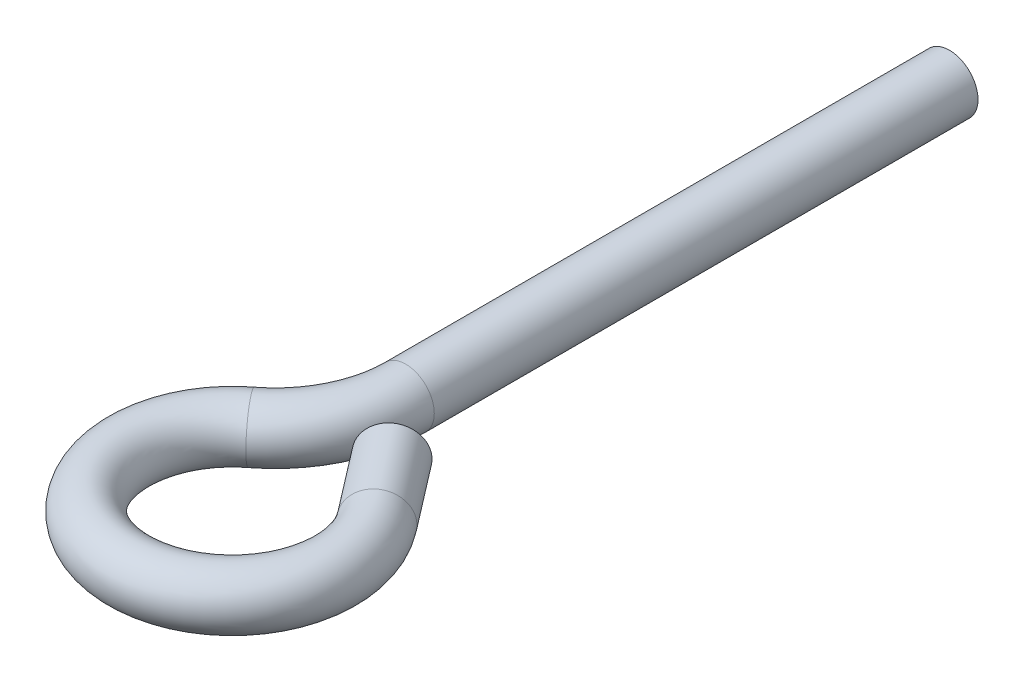
ISO-10303-21;
HEADER;
FILE_DESCRIPTION(('STEP AP214'),'2;1');
FILE_NAME('part.step','',(''),(''),'','','');
FILE_SCHEMA(('AUTOMOTIVE_DESIGN { 1 0 10303 214 1 1 1 1 }'));
ENDSEC;
DATA;
#1=APPLICATION_CONTEXT('core data for automotive mechanical design processes');
#2=APPLICATION_PROTOCOL_DEFINITION('international standard','automotive_design',2000,#1);
#3=PRODUCT_CONTEXT('',#1,'mechanical');
#4=PRODUCT('Part','Part','',(#3));
#5=PRODUCT_RELATED_PRODUCT_CATEGORY('part','',(#4));
#6=PRODUCT_DEFINITION_FORMATION('','',#4);
#7=PRODUCT_DEFINITION_CONTEXT('part definition',#1,'design');
#8=PRODUCT_DEFINITION('design','',#6,#7);
#9=PRODUCT_DEFINITION_SHAPE('','',#8);
#10=(LENGTH_UNIT() NAMED_UNIT(*) SI_UNIT(.MILLI.,.METRE.));
#11=(NAMED_UNIT(*) PLANE_ANGLE_UNIT() SI_UNIT($,.RADIAN.));
#12=(NAMED_UNIT(*) SI_UNIT($,.STERADIAN.) SOLID_ANGLE_UNIT());
#13=UNCERTAINTY_MEASURE_WITH_UNIT(LENGTH_MEASURE(1.E-05),#10,'distance_accuracy_value','');
#14=(GEOMETRIC_REPRESENTATION_CONTEXT(3) GLOBAL_UNCERTAINTY_ASSIGNED_CONTEXT((#13)) GLOBAL_UNIT_ASSIGNED_CONTEXT((#10,
#11,#12)) REPRESENTATION_CONTEXT('',''));
#15=CARTESIAN_POINT('',(0.,0.,0.));
#16=DIRECTION('',(0.,0.,1.));
#17=DIRECTION('',(1.,0.,0.));
#18=AXIS2_PLACEMENT_3D('',#15,#16,#17);
#19=CARTESIAN_POINT('',(0.,0.,50.8));
#20=DIRECTION('',(0.,0.,-1.));
#21=DIRECTION('',(-1.,0.,0.));
#22=AXIS2_PLACEMENT_3D('',#19,#20,#21);
#23=CYLINDRICAL_SURFACE('',#22,2.66699999999997);
#24=CARTESIAN_POINT('',(0.,0.,50.8));
#25=DIRECTION('',(0.,0.,1.));
#26=DIRECTION('',(1.,0.,0.));
#27=AXIS2_PLACEMENT_3D('',#24,#25,#26);
#28=CIRCLE('',#27,2.66699999999997);
#29=CARTESIAN_POINT('',(2.66699999999998,0.,50.8));
#30=VERTEX_POINT('',#29);
#31=EDGE_CURVE('E10',#30,#30,#28,.T.);
#32=ORIENTED_EDGE('',*,*,#31,.F.);
#33=EDGE_LOOP('',(#32));
#34=FACE_BOUND('',#33,.T.);
#35=CARTESIAN_POINT('',(0.,0.,0.));
#36=DIRECTION('',(0.,0.,1.));
#37=DIRECTION('',(1.,0.,0.));
#38=AXIS2_PLACEMENT_3D('',#35,#36,#37);
#39=CIRCLE('',#38,2.66699999999997);
#40=CARTESIAN_POINT('',(2.66699999999997,0.,0.));
#41=VERTEX_POINT('',#40);
#42=EDGE_CURVE('E39',#41,#41,#39,.T.);
#43=ORIENTED_EDGE('',*,*,#42,.T.);
#44=EDGE_LOOP('',(#43));
#45=FACE_BOUND('',#44,.T.);
#46=ADVANCED_FACE('F36',(#34,#45),#23,.T.);
#47=CARTESIAN_POINT('',(0.,0.,0.));
#48=DIRECTION('',(0.,0.,1.));
#49=DIRECTION('',(1.,0.,0.));
#50=AXIS2_PLACEMENT_3D('',#47,#48,#49);
#51=PLANE('',#50);
#52=ORIENTED_EDGE('',*,*,#42,.F.);
#53=EDGE_LOOP('',(#52));
#54=FACE_BOUND('',#53,.T.);
#55=ADVANCED_FACE('F73',(#54),#51,.F.);
#56=CARTESIAN_POINT('',(-12.192,0.,50.8));
#57=DIRECTION('',(0.,1.,0.));
#58=DIRECTION('',(0.,0.,1.));
#59=AXIS2_PLACEMENT_3D('',#56,#57,#58);
#60=TOROIDAL_SURFACE('',#59,12.192,2.66699999999997);
#61=CARTESIAN_POINT('',(-4.76998065752569,0.,60.4725639248307));
#62=DIRECTION('',(-0.793353340291236,0.,0.608761429008719));
#63=DIRECTION('',(0.608761429008719,0.,0.793353340291236));
#64=AXIS2_PLACEMENT_3D('',#61,#62,#63);
#65=CIRCLE('',#64,2.66699999999997);
#66=CARTESIAN_POINT('',(-3.14641392635945,0.,62.5884372833874));
#67=VERTEX_POINT('',#66);
#68=EDGE_CURVE('E46',#67,#67,#65,.T.);
#69=CARTESIAN_POINT('',(-12.192,0.,50.8));
#70=DIRECTION('',(0.,1.,0.));
#71=DIRECTION('',(0.,0.,1.));
#72=AXIS2_PLACEMENT_3D('',#69,#70,#71);
#73=CIRCLE('',#72,14.859);
#74=EDGE_CURVE('',#67,#30,#73,.T.);
#75=ORIENTED_EDGE('',*,*,#68,.F.);
#76=ORIENTED_EDGE('',*,*,#31,.T.);
#77=ORIENTED_EDGE('',*,*,#74,.T.);
#78=ORIENTED_EDGE('',*,*,#74,.F.);
#79=EDGE_LOOP('',(#75,#77,#76,#78));
#80=FACE_BOUND('',#79,.T.);
#81=ADVANCED_FACE('F68',(#80),#60,.T.);
#82=CARTESIAN_POINT('',(1.10578465526645,0.,68.1300103653217));
#83=DIRECTION('',(0.,-1.,0.));
#84=DIRECTION('',(0.,0.,-1.));
#85=AXIS2_PLACEMENT_3D('',#82,#83,#84);
#86=TOROIDAL_SURFACE('',#85,9.65199999999998,2.66699999999997);
#87=CARTESIAN_POINT('',(8.76323109575738,0.,62.2542450525295));
#88=DIRECTION('',(-0.608761429008727,0.,-0.79335334029123));
#89=DIRECTION('',(-0.79335334029123,0.,0.608761429008727));
#90=AXIS2_PLACEMENT_3D('',#87,#88,#89);
#91=CIRCLE('',#90,2.66699999999997);
#92=CARTESIAN_POINT('',(6.64735773720069,0.,63.8778117836958));
#93=VERTEX_POINT('',#92);
#94=EDGE_CURVE('E50',#93,#93,#91,.T.);
#95=ORIENTED_EDGE('',*,*,#94,.F.);
#96=EDGE_LOOP('',(#95));
#97=FACE_BOUND('',#96,.T.);
#98=ORIENTED_EDGE('',*,*,#68,.T.);
#99=EDGE_LOOP('',(#98));
#100=FACE_BOUND('',#99,.T.);
#101=ADVANCED_FACE('F62',(#97,#100),#86,.T.);
#102=CARTESIAN_POINT('',(4.1244690067109,0.,56.2088925995103));
#103=DIRECTION('',(0.608761429008727,0.,0.79335334029123));
#104=DIRECTION('',(0.79335334029123,0.,-0.608761429008727));
#105=AXIS2_PLACEMENT_3D('',#102,#103,#104);
#106=CYLINDRICAL_SURFACE('',#105,2.66699999999998);
#107=CARTESIAN_POINT('',(4.1244690067109,0.,56.2088925995103));
#108=DIRECTION('',(-0.608761429008727,0.,-0.79335334029123));
#109=DIRECTION('',(-0.79335334029123,0.,0.608761429008727));
#110=AXIS2_PLACEMENT_3D('',#107,#108,#109);
#111=CIRCLE('',#110,2.66699999999998);
#112=CARTESIAN_POINT('',(2.00859564815421,0.,57.8324593306766));
#113=VERTEX_POINT('',#112);
#114=EDGE_CURVE('E53',#113,#113,#111,.T.);
#115=ORIENTED_EDGE('',*,*,#114,.F.);
#116=EDGE_LOOP('',(#115));
#117=FACE_BOUND('',#116,.T.);
#118=ORIENTED_EDGE('',*,*,#94,.T.);
#119=EDGE_LOOP('',(#118));
#120=FACE_BOUND('',#119,.T.);
#121=ADVANCED_FACE('F59',(#117,#120),#106,.T.);
#122=CARTESIAN_POINT('',(4.1244690067109,0.,56.2088925995103));
#123=DIRECTION('',(-0.608761429008727,0.,-0.79335334029123));
#124=DIRECTION('',(-0.79335334029123,0.,0.608761429008727));
#125=AXIS2_PLACEMENT_3D('',#122,#123,#124);
#126=PLANE('',#125);
#127=ORIENTED_EDGE('',*,*,#114,.T.);
#128=EDGE_LOOP('',(#127));
#129=FACE_BOUND('',#128,.T.);
#130=ADVANCED_FACE('F57',(#129),#126,.T.);
#131=CLOSED_SHELL('',(#46,#55,#81,#101,#121,#130));
#132=MANIFOLD_SOLID_BREP('B2',#131);
#133=ADVANCED_BREP_SHAPE_REPRESENTATION('',(#18,#132),#14);
#134=SHAPE_DEFINITION_REPRESENTATION(#9,#133);
ENDSEC;
END-ISO-10303-21;
